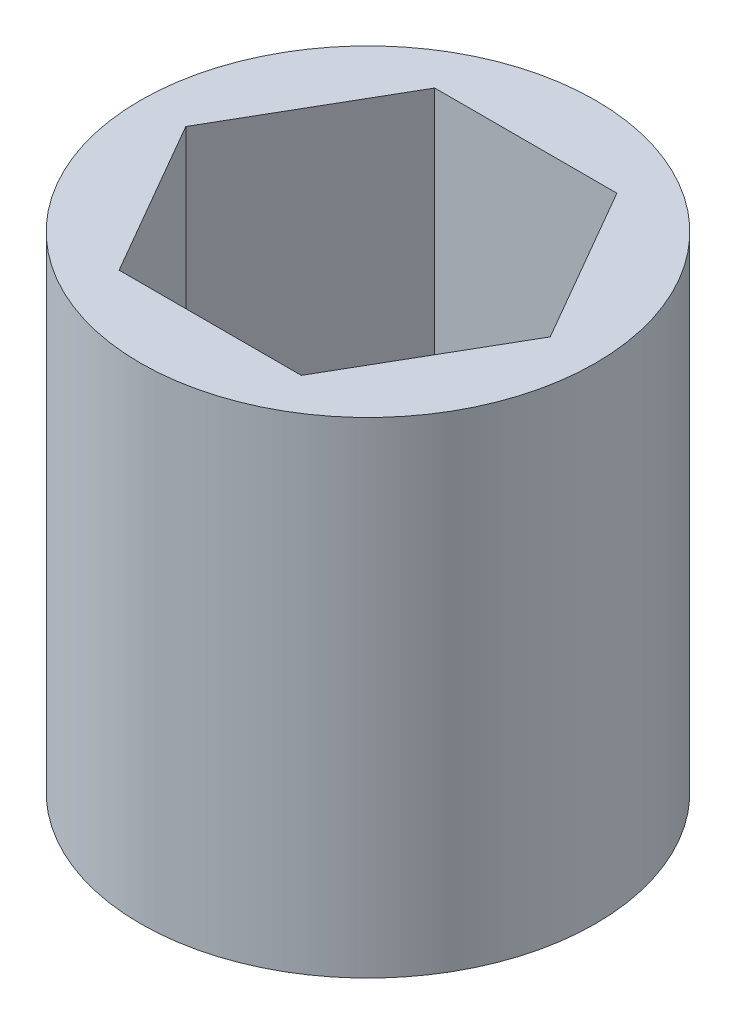
ISO-10303-21;
HEADER;
FILE_DESCRIPTION(('STEP AP214'),'2;1');
FILE_NAME('part.step','',(''),(''),'','','');
FILE_SCHEMA(('AUTOMOTIVE_DESIGN { 1 0 10303 214 1 1 1 1 }'));
ENDSEC;
DATA;
#1=APPLICATION_CONTEXT('core data for automotive mechanical design processes');
#2=APPLICATION_PROTOCOL_DEFINITION('international standard','automotive_design',2000,#1);
#3=PRODUCT_CONTEXT('',#1,'mechanical');
#4=PRODUCT('Part','Part','',(#3));
#5=PRODUCT_RELATED_PRODUCT_CATEGORY('part','',(#4));
#6=PRODUCT_DEFINITION_FORMATION('','',#4);
#7=PRODUCT_DEFINITION_CONTEXT('part definition',#1,'design');
#8=PRODUCT_DEFINITION('design','',#6,#7);
#9=PRODUCT_DEFINITION_SHAPE('','',#8);
#10=(LENGTH_UNIT() NAMED_UNIT(*) SI_UNIT(.MILLI.,.METRE.));
#11=(NAMED_UNIT(*) PLANE_ANGLE_UNIT() SI_UNIT($,.RADIAN.));
#12=(NAMED_UNIT(*) SI_UNIT($,.STERADIAN.) SOLID_ANGLE_UNIT());
#13=UNCERTAINTY_MEASURE_WITH_UNIT(LENGTH_MEASURE(1.E-05),#10,'distance_accuracy_value','');
#14=(GEOMETRIC_REPRESENTATION_CONTEXT(3) GLOBAL_UNCERTAINTY_ASSIGNED_CONTEXT((#13)) GLOBAL_UNIT_ASSIGNED_CONTEXT((#10,
#11,#12)) REPRESENTATION_CONTEXT('',''));
#15=CARTESIAN_POINT('',(0.,0.,0.));
#16=DIRECTION('',(0.,0.,1.));
#17=DIRECTION('',(1.,0.,0.));
#18=AXIS2_PLACEMENT_3D('',#15,#16,#17);
#19=CARTESIAN_POINT('',(0.,20.32,0.));
#20=DIRECTION('',(0.,1.,0.));
#21=DIRECTION('',(0.,0.,1.));
#22=AXIS2_PLACEMENT_3D('',#19,#20,#21);
#23=PLANE('',#22);
#24=CARTESIAN_POINT('',(0.,20.32,0.));
#25=DIRECTION('',(0.,1.,0.));
#26=DIRECTION('',(0.,0.,1.));
#27=AXIS2_PLACEMENT_3D('',#24,#25,#26);
#28=CIRCLE('',#27,9.525);
#29=CARTESIAN_POINT('',(0.,20.32,9.525));
#30=VERTEX_POINT('',#29);
#31=EDGE_CURVE('E11',#30,#30,#28,.T.);
#32=ORIENTED_EDGE('',*,*,#31,.T.);
#33=EDGE_LOOP('',(#32));
#34=FACE_BOUND('',#33,.T.);
#35=DIRECTION('',(-1.,0.,0.));
#36=VECTOR('',#35,1.);
#37=CARTESIAN_POINT('',(3.81282117772829,20.32,-6.604));
#38=LINE('',#37,#36);
#39=CARTESIAN_POINT('',(3.81282117772829,20.32,-6.604));
#40=VERTEX_POINT('',#39);
#41=CARTESIAN_POINT('',(-3.81282117772829,20.32,-6.604));
#42=VERTEX_POINT('',#41);
#43=EDGE_CURVE('E94',#40,#42,#38,.T.);
#44=ORIENTED_EDGE('',*,*,#43,.F.);
#45=DIRECTION('',(-0.5,0.,-0.866025403784438));
#46=VECTOR('',#45,1.);
#47=CARTESIAN_POINT('',(7.62564235545658,20.32,0.));
#48=LINE('',#47,#46);
#49=CARTESIAN_POINT('',(7.62564235545658,20.32,0.));
#50=VERTEX_POINT('',#49);
#51=EDGE_CURVE('E86',#50,#40,#48,.T.);
#52=ORIENTED_EDGE('',*,*,#51,.F.);
#53=DIRECTION('',(0.5,0.,-0.866025403784439));
#54=VECTOR('',#53,1.);
#55=CARTESIAN_POINT('',(3.81282117772829,20.32,6.604));
#56=LINE('',#55,#54);
#57=CARTESIAN_POINT('',(3.81282117772829,20.32,6.604));
#58=VERTEX_POINT('',#57);
#59=EDGE_CURVE('E114',#58,#50,#56,.T.);
#60=ORIENTED_EDGE('',*,*,#59,.F.);
#61=DIRECTION('',(1.,0.,0.));
#62=VECTOR('',#61,1.);
#63=CARTESIAN_POINT('',(-3.81282117772828,20.32,6.604));
#64=LINE('',#63,#62);
#65=CARTESIAN_POINT('',(-3.81282117772828,20.32,6.604));
#66=VERTEX_POINT('',#65);
#67=EDGE_CURVE('E112',#66,#58,#64,.T.);
#68=ORIENTED_EDGE('',*,*,#67,.F.);
#69=DIRECTION('',(0.5,0.,0.866025403784438));
#70=VECTOR('',#69,1.);
#71=CARTESIAN_POINT('',(-7.62564235545657,20.32,0.));
#72=LINE('',#71,#70);
#73=CARTESIAN_POINT('',(-7.62564235545657,20.32,0.));
#74=VERTEX_POINT('',#73);
#75=EDGE_CURVE('E108',#74,#66,#72,.T.);
#76=ORIENTED_EDGE('',*,*,#75,.F.);
#77=DIRECTION('',(-0.5,0.,0.866025403784439));
#78=VECTOR('',#77,1.);
#79=CARTESIAN_POINT('',(-3.81282117772829,20.32,-6.604));
#80=LINE('',#79,#78);
#81=EDGE_CURVE('E106',#42,#74,#80,.T.);
#82=ORIENTED_EDGE('',*,*,#81,.F.);
#83=EDGE_LOOP('',(#44,#52,#60,#68,#76,#82));
#84=FACE_BOUND('',#83,.T.);
#85=ADVANCED_FACE('F33',(#34,#84),#23,.T.);
#86=CARTESIAN_POINT('',(0.,0.,0.));
#87=DIRECTION('',(0.,1.,0.));
#88=DIRECTION('',(0.,0.,1.));
#89=AXIS2_PLACEMENT_3D('',#86,#87,#88);
#90=PLANE('',#89);
#91=CARTESIAN_POINT('',(0.,0.,0.));
#92=DIRECTION('',(0.,1.,0.));
#93=DIRECTION('',(0.,0.,1.));
#94=AXIS2_PLACEMENT_3D('',#91,#92,#93);
#95=CIRCLE('',#94,9.525);
#96=CARTESIAN_POINT('',(0.,0.,9.525));
#97=VERTEX_POINT('',#96);
#98=EDGE_CURVE('E37',#97,#97,#95,.T.);
#99=ORIENTED_EDGE('',*,*,#98,.F.);
#100=EDGE_LOOP('',(#99));
#101=FACE_BOUND('',#100,.T.);
#102=DIRECTION('',(-0.5,0.,-0.866025403784438));
#103=VECTOR('',#102,1.);
#104=CARTESIAN_POINT('',(7.62564235545658,0.,0.));
#105=LINE('',#104,#103);
#106=CARTESIAN_POINT('',(7.62564235545658,0.,0.));
#107=VERTEX_POINT('',#106);
#108=CARTESIAN_POINT('',(3.81282117772829,0.,-6.604));
#109=VERTEX_POINT('',#108);
#110=EDGE_CURVE('E56',#107,#109,#105,.T.);
#111=ORIENTED_EDGE('',*,*,#110,.T.);
#112=DIRECTION('',(-1.,0.,0.));
#113=VECTOR('',#112,1.);
#114=CARTESIAN_POINT('',(3.81282117772829,0.,-6.604));
#115=LINE('',#114,#113);
#116=CARTESIAN_POINT('',(-3.81282117772829,0.,-6.604));
#117=VERTEX_POINT('',#116);
#118=EDGE_CURVE('E101',#109,#117,#115,.T.);
#119=ORIENTED_EDGE('',*,*,#118,.T.);
#120=DIRECTION('',(-0.5,0.,0.866025403784439));
#121=VECTOR('',#120,1.);
#122=CARTESIAN_POINT('',(-3.81282117772829,0.,-6.604));
#123=LINE('',#122,#121);
#124=CARTESIAN_POINT('',(-7.62564235545657,0.,0.));
#125=VERTEX_POINT('',#124);
#126=EDGE_CURVE('E118',#117,#125,#123,.T.);
#127=ORIENTED_EDGE('',*,*,#126,.T.);
#128=DIRECTION('',(0.5,0.,0.866025403784438));
#129=VECTOR('',#128,1.);
#130=CARTESIAN_POINT('',(-7.62564235545657,0.,0.));
#131=LINE('',#130,#129);
#132=CARTESIAN_POINT('',(-3.81282117772828,0.,6.604));
#133=VERTEX_POINT('',#132);
#134=EDGE_CURVE('E121',#125,#133,#131,.T.);
#135=ORIENTED_EDGE('',*,*,#134,.T.);
#136=DIRECTION('',(1.,0.,0.));
#137=VECTOR('',#136,1.);
#138=CARTESIAN_POINT('',(-3.81282117772828,0.,6.604));
#139=LINE('',#138,#137);
#140=CARTESIAN_POINT('',(3.81282117772829,0.,6.604));
#141=VERTEX_POINT('',#140);
#142=EDGE_CURVE('E124',#133,#141,#139,.T.);
#143=ORIENTED_EDGE('',*,*,#142,.T.);
#144=DIRECTION('',(0.5,0.,-0.866025403784439));
#145=VECTOR('',#144,1.);
#146=CARTESIAN_POINT('',(3.81282117772829,0.,6.604));
#147=LINE('',#146,#145);
#148=EDGE_CURVE('E95',#141,#107,#147,.T.);
#149=ORIENTED_EDGE('',*,*,#148,.T.);
#150=EDGE_LOOP('',(#111,#119,#127,#135,#143,#149));
#151=FACE_BOUND('',#150,.T.);
#152=ADVANCED_FACE('F141',(#101,#151),#90,.F.);
#153=CARTESIAN_POINT('',(0.,20.32,0.));
#154=DIRECTION('',(0.,-1.,0.));
#155=DIRECTION('',(0.,0.,-1.));
#156=AXIS2_PLACEMENT_3D('',#153,#154,#155);
#157=CYLINDRICAL_SURFACE('',#156,9.525);
#158=ORIENTED_EDGE('',*,*,#31,.F.);
#159=EDGE_LOOP('',(#158));
#160=FACE_BOUND('',#159,.T.);
#161=ORIENTED_EDGE('',*,*,#98,.T.);
#162=EDGE_LOOP('',(#161));
#163=FACE_BOUND('',#162,.T.);
#164=ADVANCED_FACE('F35',(#160,#163),#157,.T.);
#165=CARTESIAN_POINT('',(7.62564235545658,20.32,0.));
#166=DIRECTION('',(-0.866025403784438,0.,0.5));
#167=DIRECTION('',(0.5,0.,0.866025403784439));
#168=AXIS2_PLACEMENT_3D('',#165,#166,#167);
#169=PLANE('',#168);
#170=ORIENTED_EDGE('',*,*,#110,.F.);
#171=DIRECTION('',(0.,-1.,0.));
#172=VECTOR('',#171,1.);
#173=CARTESIAN_POINT('',(7.62564235545658,20.32,0.));
#174=LINE('',#173,#172);
#175=EDGE_CURVE('E90',#50,#107,#174,.T.);
#176=ORIENTED_EDGE('',*,*,#175,.F.);
#177=ORIENTED_EDGE('',*,*,#51,.T.);
#178=DIRECTION('',(0.,-1.,0.));
#179=VECTOR('',#178,1.);
#180=CARTESIAN_POINT('',(3.81282117772829,20.32,-6.604));
#181=LINE('',#180,#179);
#182=EDGE_CURVE('E89',#40,#109,#181,.T.);
#183=ORIENTED_EDGE('',*,*,#182,.T.);
#184=EDGE_LOOP('',(#170,#176,#177,#183));
#185=FACE_BOUND('',#184,.T.);
#186=ADVANCED_FACE('F88',(#185),#169,.T.);
#187=CARTESIAN_POINT('',(3.81282117772829,20.32,-6.604));
#188=DIRECTION('',(0.,0.,1.));
#189=DIRECTION('',(1.,0.,0.));
#190=AXIS2_PLACEMENT_3D('',#187,#188,#189);
#191=PLANE('',#190);
#192=ORIENTED_EDGE('',*,*,#118,.F.);
#193=ORIENTED_EDGE('',*,*,#182,.F.);
#194=ORIENTED_EDGE('',*,*,#43,.T.);
#195=DIRECTION('',(0.,-1.,0.));
#196=VECTOR('',#195,1.);
#197=CARTESIAN_POINT('',(-3.81282117772829,20.32,-6.604));
#198=LINE('',#197,#196);
#199=EDGE_CURVE('E102',#42,#117,#198,.T.);
#200=ORIENTED_EDGE('',*,*,#199,.T.);
#201=EDGE_LOOP('',(#192,#193,#194,#200));
#202=FACE_BOUND('',#201,.T.);
#203=ADVANCED_FACE('F98',(#202),#191,.T.);
#204=CARTESIAN_POINT('',(-3.81282117772829,20.32,-6.604));
#205=DIRECTION('',(0.866025403784439,0.,0.5));
#206=DIRECTION('',(0.5,0.,-0.866025403784439));
#207=AXIS2_PLACEMENT_3D('',#204,#205,#206);
#208=PLANE('',#207);
#209=ORIENTED_EDGE('',*,*,#126,.F.);
#210=ORIENTED_EDGE('',*,*,#199,.F.);
#211=ORIENTED_EDGE('',*,*,#81,.T.);
#212=DIRECTION('',(0.,-1.,0.));
#213=VECTOR('',#212,1.);
#214=CARTESIAN_POINT('',(-7.62564235545657,20.32,0.));
#215=LINE('',#214,#213);
#216=EDGE_CURVE('E133',#74,#125,#215,.T.);
#217=ORIENTED_EDGE('',*,*,#216,.T.);
#218=EDGE_LOOP('',(#209,#210,#211,#217));
#219=FACE_BOUND('',#218,.T.);
#220=ADVANCED_FACE('F137',(#219),#208,.T.);
#221=CARTESIAN_POINT('',(-7.62564235545657,20.32,0.));
#222=DIRECTION('',(0.866025403784438,0.,-0.5));
#223=DIRECTION('',(-0.5,0.,-0.866025403784438));
#224=AXIS2_PLACEMENT_3D('',#221,#222,#223);
#225=PLANE('',#224);
#226=ORIENTED_EDGE('',*,*,#134,.F.);
#227=ORIENTED_EDGE('',*,*,#216,.F.);
#228=ORIENTED_EDGE('',*,*,#75,.T.);
#229=DIRECTION('',(0.,-1.,0.));
#230=VECTOR('',#229,1.);
#231=CARTESIAN_POINT('',(-3.81282117772828,20.32,6.604));
#232=LINE('',#231,#230);
#233=EDGE_CURVE('E131',#66,#133,#232,.T.);
#234=ORIENTED_EDGE('',*,*,#233,.T.);
#235=EDGE_LOOP('',(#226,#227,#228,#234));
#236=FACE_BOUND('',#235,.T.);
#237=ADVANCED_FACE('F149',(#236),#225,.T.);
#238=CARTESIAN_POINT('',(-3.81282117772828,20.32,6.604));
#239=DIRECTION('',(0.,0.,-1.));
#240=DIRECTION('',(-1.,0.,0.));
#241=AXIS2_PLACEMENT_3D('',#238,#239,#240);
#242=PLANE('',#241);
#243=ORIENTED_EDGE('',*,*,#142,.F.);
#244=ORIENTED_EDGE('',*,*,#233,.F.);
#245=ORIENTED_EDGE('',*,*,#67,.T.);
#246=DIRECTION('',(0.,-1.,0.));
#247=VECTOR('',#246,1.);
#248=CARTESIAN_POINT('',(3.81282117772829,20.32,6.604));
#249=LINE('',#248,#247);
#250=EDGE_CURVE('E48',#58,#141,#249,.T.);
#251=ORIENTED_EDGE('',*,*,#250,.T.);
#252=EDGE_LOOP('',(#243,#244,#245,#251));
#253=FACE_BOUND('',#252,.T.);
#254=ADVANCED_FACE('F147',(#253),#242,.T.);
#255=CARTESIAN_POINT('',(3.81282117772829,20.32,6.604));
#256=DIRECTION('',(-0.866025403784439,0.,-0.5));
#257=DIRECTION('',(-0.5,0.,0.866025403784439));
#258=AXIS2_PLACEMENT_3D('',#255,#256,#257);
#259=PLANE('',#258);
#260=ORIENTED_EDGE('',*,*,#148,.F.);
#261=ORIENTED_EDGE('',*,*,#250,.F.);
#262=ORIENTED_EDGE('',*,*,#59,.T.);
#263=ORIENTED_EDGE('',*,*,#175,.T.);
#264=EDGE_LOOP('',(#260,#261,#262,#263));
#265=FACE_BOUND('',#264,.T.);
#266=ADVANCED_FACE('F143',(#265),#259,.T.);
#267=CLOSED_SHELL('',(#85,#152,#164,#186,#203,#220,#237,#254,#266));
#268=MANIFOLD_SOLID_BREP('B2',#267);
#269=ADVANCED_BREP_SHAPE_REPRESENTATION('',(#18,#268),#14);
#270=SHAPE_DEFINITION_REPRESENTATION(#9,#269);
ENDSEC;
END-ISO-10303-21;
